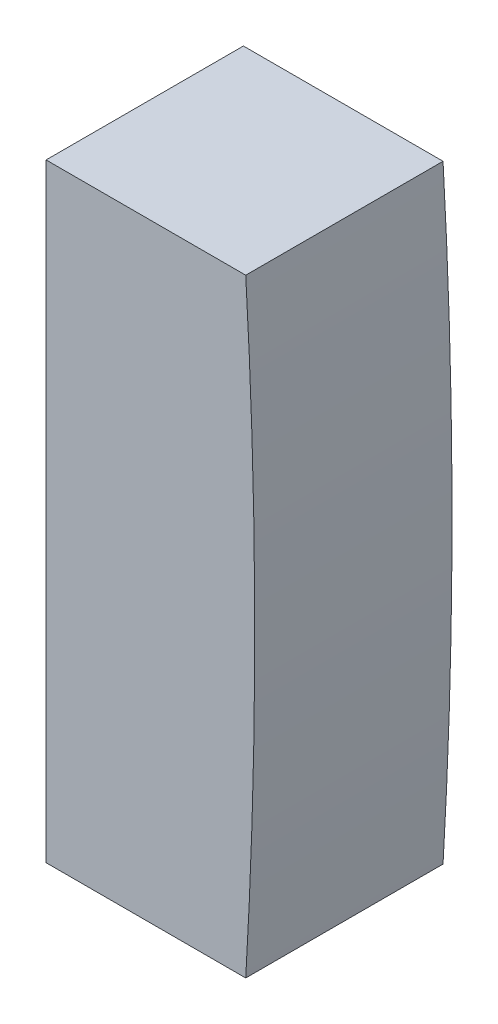
ISO-10303-21;
HEADER;
FILE_DESCRIPTION(('STEP AP214'),'2;1');
FILE_NAME('part.step','',(''),(''),'','','');
FILE_SCHEMA(('AUTOMOTIVE_DESIGN { 1 0 10303 214 1 1 1 1 }'));
ENDSEC;
DATA;
#1=APPLICATION_CONTEXT('core data for automotive mechanical design processes');
#2=APPLICATION_PROTOCOL_DEFINITION('international standard','automotive_design',2000,#1);
#3=PRODUCT_CONTEXT('',#1,'mechanical');
#4=PRODUCT('Part','Part','',(#3));
#5=PRODUCT_RELATED_PRODUCT_CATEGORY('part','',(#4));
#6=PRODUCT_DEFINITION_FORMATION('','',#4);
#7=PRODUCT_DEFINITION_CONTEXT('part definition',#1,'design');
#8=PRODUCT_DEFINITION('design','',#6,#7);
#9=PRODUCT_DEFINITION_SHAPE('','',#8);
#10=(LENGTH_UNIT() NAMED_UNIT(*) SI_UNIT(.MILLI.,.METRE.));
#11=(NAMED_UNIT(*) PLANE_ANGLE_UNIT() SI_UNIT($,.RADIAN.));
#12=(NAMED_UNIT(*) SI_UNIT($,.STERADIAN.) SOLID_ANGLE_UNIT());
#13=UNCERTAINTY_MEASURE_WITH_UNIT(LENGTH_MEASURE(1.E-05),#10,'distance_accuracy_value','');
#14=(GEOMETRIC_REPRESENTATION_CONTEXT(3) GLOBAL_UNCERTAINTY_ASSIGNED_CONTEXT((#13)) GLOBAL_UNIT_ASSIGNED_CONTEXT((#10,
#11,#12)) REPRESENTATION_CONTEXT('',''));
#15=CARTESIAN_POINT('',(0.,0.,0.));
#16=DIRECTION('',(0.,0.,1.));
#17=DIRECTION('',(1.,0.,0.));
#18=AXIS2_PLACEMENT_3D('',#15,#16,#17);
#19=CARTESIAN_POINT('',(0.,0.,2.715));
#20=DIRECTION('',(0.,0.,-1.));
#21=DIRECTION('',(-1.,0.,0.));
#22=AXIS2_PLACEMENT_3D('',#19,#20,#21);
#23=CYLINDRICAL_SURFACE('',#22,142.);
#24=CARTESIAN_POINT('',(0.,0.,-2.715));
#25=DIRECTION('',(0.,0.,1.));
#26=DIRECTION('',(-1.,0.,0.));
#27=AXIS2_PLACEMENT_3D('',#24,#25,#26);
#28=CIRCLE('',#27,142.);
#29=CARTESIAN_POINT('',(141.752810818692,-8.375,-2.715));
#30=VERTEX_POINT('',#29);
#31=CARTESIAN_POINT('',(141.752810818692,8.375,-2.715));
#32=VERTEX_POINT('',#31);
#33=EDGE_CURVE('E94',#30,#32,#28,.T.);
#34=ORIENTED_EDGE('',*,*,#33,.T.);
#35=DIRECTION('',(0.,0.,-1.));
#36=VECTOR('',#35,1.);
#37=CARTESIAN_POINT('',(141.752810818692,8.375,2.715));
#38=LINE('',#37,#36);
#39=CARTESIAN_POINT('',(141.752810818692,8.375,2.715));
#40=VERTEX_POINT('',#39);
#41=EDGE_CURVE('E11',#40,#32,#38,.T.);
#42=ORIENTED_EDGE('',*,*,#41,.F.);
#43=CARTESIAN_POINT('',(0.,0.,2.715));
#44=DIRECTION('',(0.,0.,1.));
#45=DIRECTION('',(-1.,0.,0.));
#46=AXIS2_PLACEMENT_3D('',#43,#44,#45);
#47=CIRCLE('',#46,142.);
#48=CARTESIAN_POINT('',(141.752810818692,-8.375,2.715));
#49=VERTEX_POINT('',#48);
#50=EDGE_CURVE('E82',#49,#40,#47,.T.);
#51=ORIENTED_EDGE('',*,*,#50,.F.);
#52=DIRECTION('',(0.,0.,-1.));
#53=VECTOR('',#52,1.);
#54=CARTESIAN_POINT('',(141.752810818692,-8.375,2.715));
#55=LINE('',#54,#53);
#56=EDGE_CURVE('E90',#49,#30,#55,.T.);
#57=ORIENTED_EDGE('',*,*,#56,.T.);
#58=EDGE_LOOP('',(#34,#42,#51,#57));
#59=FACE_BOUND('',#58,.T.);
#60=ADVANCED_FACE('F31',(#59),#23,.T.);
#61=CARTESIAN_POINT('',(141.752810818692,8.375,2.715));
#62=DIRECTION('',(0.,-1.,0.));
#63=DIRECTION('',(0.,0.,-1.));
#64=AXIS2_PLACEMENT_3D('',#61,#62,#63);
#65=PLANE('',#64);
#66=DIRECTION('',(-1.,0.,0.));
#67=VECTOR('',#66,1.);
#68=CARTESIAN_POINT('',(141.752810818692,8.375,-2.715));
#69=LINE('',#68,#67);
#70=CARTESIAN_POINT('',(136.25860116,8.375,-2.715));
#71=VERTEX_POINT('',#70);
#72=EDGE_CURVE('E86',#32,#71,#69,.T.);
#73=ORIENTED_EDGE('',*,*,#72,.T.);
#74=DIRECTION('',(0.,0.,-1.));
#75=VECTOR('',#74,1.);
#76=CARTESIAN_POINT('',(136.25860116,8.375,2.715));
#77=LINE('',#76,#75);
#78=CARTESIAN_POINT('',(136.25860116,8.375,2.715));
#79=VERTEX_POINT('',#78);
#80=EDGE_CURVE('E39',#79,#71,#77,.T.);
#81=ORIENTED_EDGE('',*,*,#80,.F.);
#82=DIRECTION('',(-1.,0.,0.));
#83=VECTOR('',#82,1.);
#84=CARTESIAN_POINT('',(141.752810818692,8.375,2.715));
#85=LINE('',#84,#83);
#86=EDGE_CURVE('E77',#40,#79,#85,.T.);
#87=ORIENTED_EDGE('',*,*,#86,.F.);
#88=ORIENTED_EDGE('',*,*,#41,.T.);
#89=EDGE_LOOP('',(#73,#81,#87,#88));
#90=FACE_BOUND('',#89,.T.);
#91=ADVANCED_FACE('F85',(#90),#65,.F.);
#92=CARTESIAN_POINT('',(136.25860116,8.375,2.715));
#93=DIRECTION('',(1.,0.,0.));
#94=DIRECTION('',(0.,0.,-1.));
#95=AXIS2_PLACEMENT_3D('',#92,#93,#94);
#96=PLANE('',#95);
#97=DIRECTION('',(0.,-1.,0.));
#98=VECTOR('',#97,1.);
#99=CARTESIAN_POINT('',(136.25860116,8.375,-2.715));
#100=LINE('',#99,#98);
#101=CARTESIAN_POINT('',(136.25860116,-8.375,-2.715));
#102=VERTEX_POINT('',#101);
#103=EDGE_CURVE('E64',#71,#102,#100,.T.);
#104=ORIENTED_EDGE('',*,*,#103,.T.);
#105=DIRECTION('',(0.,0.,-1.));
#106=VECTOR('',#105,1.);
#107=CARTESIAN_POINT('',(136.25860116,-8.375,2.715));
#108=LINE('',#107,#106);
#109=CARTESIAN_POINT('',(136.25860116,-8.375,2.715));
#110=VERTEX_POINT('',#109);
#111=EDGE_CURVE('E87',#110,#102,#108,.T.);
#112=ORIENTED_EDGE('',*,*,#111,.F.);
#113=DIRECTION('',(0.,-1.,0.));
#114=VECTOR('',#113,1.);
#115=CARTESIAN_POINT('',(136.25860116,8.375,2.715));
#116=LINE('',#115,#114);
#117=EDGE_CURVE('E80',#79,#110,#116,.T.);
#118=ORIENTED_EDGE('',*,*,#117,.F.);
#119=ORIENTED_EDGE('',*,*,#80,.T.);
#120=EDGE_LOOP('',(#104,#112,#118,#119));
#121=FACE_BOUND('',#120,.T.);
#122=ADVANCED_FACE('F88',(#121),#96,.F.);
#123=CARTESIAN_POINT('',(141.752810818692,-8.375,2.715));
#124=DIRECTION('',(0.,1.,0.));
#125=DIRECTION('',(0.,0.,1.));
#126=AXIS2_PLACEMENT_3D('',#123,#124,#125);
#127=PLANE('',#126);
#128=DIRECTION('',(1.,0.,0.));
#129=VECTOR('',#128,1.);
#130=CARTESIAN_POINT('',(141.752810818692,-8.375,-2.715));
#131=LINE('',#130,#129);
#132=EDGE_CURVE('E70',#102,#30,#131,.T.);
#133=ORIENTED_EDGE('',*,*,#132,.T.);
#134=ORIENTED_EDGE('',*,*,#56,.F.);
#135=DIRECTION('',(1.,0.,0.));
#136=VECTOR('',#135,1.);
#137=CARTESIAN_POINT('',(141.752810818692,-8.375,2.715));
#138=LINE('',#137,#136);
#139=EDGE_CURVE('E47',#110,#49,#138,.T.);
#140=ORIENTED_EDGE('',*,*,#139,.F.);
#141=ORIENTED_EDGE('',*,*,#111,.T.);
#142=EDGE_LOOP('',(#133,#134,#140,#141));
#143=FACE_BOUND('',#142,.T.);
#144=ADVANCED_FACE('F101',(#143),#127,.F.);
#145=CARTESIAN_POINT('',(0.,0.,2.715));
#146=DIRECTION('',(0.,0.,-1.));
#147=DIRECTION('',(-1.,0.,0.));
#148=AXIS2_PLACEMENT_3D('',#145,#146,#147);
#149=PLANE('',#148);
#150=ORIENTED_EDGE('',*,*,#50,.T.);
#151=ORIENTED_EDGE('',*,*,#86,.T.);
#152=ORIENTED_EDGE('',*,*,#117,.T.);
#153=ORIENTED_EDGE('',*,*,#139,.T.);
#154=EDGE_LOOP('',(#150,#151,#152,#153));
#155=FACE_BOUND('',#154,.T.);
#156=ADVANCED_FACE('F78',(#155),#149,.F.);
#157=CARTESIAN_POINT('',(0.,0.,-2.715));
#158=DIRECTION('',(0.,0.,-1.));
#159=DIRECTION('',(-1.,0.,0.));
#160=AXIS2_PLACEMENT_3D('',#157,#158,#159);
#161=PLANE('',#160);
#162=ORIENTED_EDGE('',*,*,#33,.F.);
#163=ORIENTED_EDGE('',*,*,#132,.F.);
#164=ORIENTED_EDGE('',*,*,#103,.F.);
#165=ORIENTED_EDGE('',*,*,#72,.F.);
#166=EDGE_LOOP('',(#162,#163,#164,#165));
#167=FACE_BOUND('',#166,.T.);
#168=ADVANCED_FACE('F104',(#167),#161,.T.);
#169=CLOSED_SHELL('',(#60,#91,#122,#144,#156,#168));
#170=MANIFOLD_SOLID_BREP('B2',#169);
#171=ADVANCED_BREP_SHAPE_REPRESENTATION('',(#18,#170),#14);
#172=SHAPE_DEFINITION_REPRESENTATION(#9,#171);
ENDSEC;
END-ISO-10303-21;
